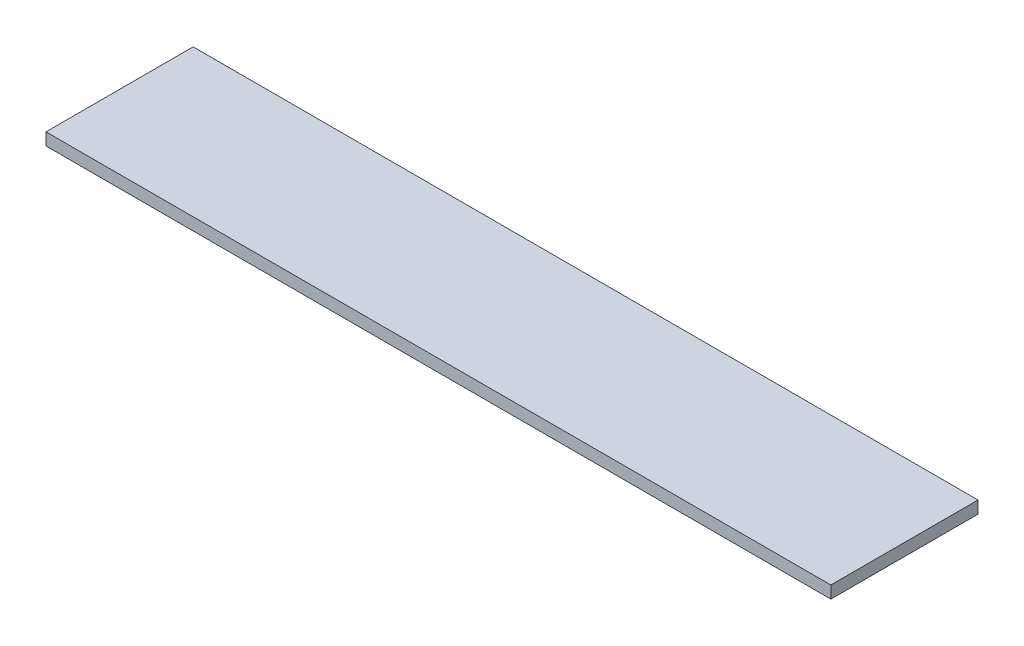
ISO-10303-21;
HEADER;
FILE_DESCRIPTION(('STEP AP214'),'2;1');
FILE_NAME('part.step','',(''),(''),'','','');
FILE_SCHEMA(('AUTOMOTIVE_DESIGN { 1 0 10303 214 1 1 1 1 }'));
ENDSEC;
DATA;
#1=APPLICATION_CONTEXT('core data for automotive mechanical design processes');
#2=APPLICATION_PROTOCOL_DEFINITION('international standard','automotive_design',2000,#1);
#3=PRODUCT_CONTEXT('',#1,'mechanical');
#4=PRODUCT('Part','Part','',(#3));
#5=PRODUCT_RELATED_PRODUCT_CATEGORY('part','',(#4));
#6=PRODUCT_DEFINITION_FORMATION('','',#4);
#7=PRODUCT_DEFINITION_CONTEXT('part definition',#1,'design');
#8=PRODUCT_DEFINITION('design','',#6,#7);
#9=PRODUCT_DEFINITION_SHAPE('','',#8);
#10=(LENGTH_UNIT() NAMED_UNIT(*) SI_UNIT(.MILLI.,.METRE.));
#11=(NAMED_UNIT(*) PLANE_ANGLE_UNIT() SI_UNIT($,.RADIAN.));
#12=(NAMED_UNIT(*) SI_UNIT($,.STERADIAN.) SOLID_ANGLE_UNIT());
#13=UNCERTAINTY_MEASURE_WITH_UNIT(LENGTH_MEASURE(1.E-05),#10,'distance_accuracy_value','');
#14=(GEOMETRIC_REPRESENTATION_CONTEXT(3) GLOBAL_UNCERTAINTY_ASSIGNED_CONTEXT((#13)) GLOBAL_UNIT_ASSIGNED_CONTEXT((#10,
#11,#12)) REPRESENTATION_CONTEXT('',''));
#15=CARTESIAN_POINT('',(0.,0.,0.));
#16=DIRECTION('',(0.,0.,1.));
#17=DIRECTION('',(1.,0.,0.));
#18=AXIS2_PLACEMENT_3D('',#15,#16,#17);
#19=CARTESIAN_POINT('',(0.,6.35,0.));
#20=DIRECTION('',(1.,0.,0.));
#21=DIRECTION('',(0.,0.,-1.));
#22=AXIS2_PLACEMENT_3D('',#19,#20,#21);
#23=PLANE('',#22);
#24=DIRECTION('',(0.,0.,1.));
#25=VECTOR('',#24,1.);
#26=CARTESIAN_POINT('',(0.,0.,0.));
#27=LINE('',#26,#25);
#28=CARTESIAN_POINT('',(0.,0.,-76.2));
#29=VERTEX_POINT('',#28);
#30=CARTESIAN_POINT('',(0.,0.,0.));
#31=VERTEX_POINT('',#30);
#32=EDGE_CURVE('E96',#29,#31,#27,.T.);
#33=ORIENTED_EDGE('',*,*,#32,.T.);
#34=DIRECTION('',(0.,-1.,0.));
#35=VECTOR('',#34,1.);
#36=CARTESIAN_POINT('',(0.,6.35,0.));
#37=LINE('',#36,#35);
#38=CARTESIAN_POINT('',(0.,6.35,0.));
#39=VERTEX_POINT('',#38);
#40=EDGE_CURVE('E11',#39,#31,#37,.T.);
#41=ORIENTED_EDGE('',*,*,#40,.F.);
#42=DIRECTION('',(0.,0.,1.));
#43=VECTOR('',#42,1.);
#44=CARTESIAN_POINT('',(0.,6.35,0.));
#45=LINE('',#44,#43);
#46=CARTESIAN_POINT('',(0.,6.35,-76.2));
#47=VERTEX_POINT('',#46);
#48=EDGE_CURVE('E84',#47,#39,#45,.T.);
#49=ORIENTED_EDGE('',*,*,#48,.F.);
#50=DIRECTION('',(0.,-1.,0.));
#51=VECTOR('',#50,1.);
#52=CARTESIAN_POINT('',(0.,6.35,-76.2));
#53=LINE('',#52,#51);
#54=EDGE_CURVE('E92',#47,#29,#53,.T.);
#55=ORIENTED_EDGE('',*,*,#54,.T.);
#56=EDGE_LOOP('',(#33,#41,#49,#55));
#57=FACE_BOUND('',#56,.T.);
#58=ADVANCED_FACE('F33',(#57),#23,.F.);
#59=CARTESIAN_POINT('',(0.,6.35,0.));
#60=DIRECTION('',(0.,0.,-1.));
#61=DIRECTION('',(-1.,0.,0.));
#62=AXIS2_PLACEMENT_3D('',#59,#60,#61);
#63=PLANE('',#62);
#64=DIRECTION('',(1.,0.,0.));
#65=VECTOR('',#64,1.);
#66=CARTESIAN_POINT('',(0.,0.,0.));
#67=LINE('',#66,#65);
#68=CARTESIAN_POINT('',(406.4,0.,0.));
#69=VERTEX_POINT('',#68);
#70=EDGE_CURVE('E88',#31,#69,#67,.T.);
#71=ORIENTED_EDGE('',*,*,#70,.T.);
#72=DIRECTION('',(0.,-1.,0.));
#73=VECTOR('',#72,1.);
#74=CARTESIAN_POINT('',(406.4,6.35,0.));
#75=LINE('',#74,#73);
#76=CARTESIAN_POINT('',(406.4,6.35,0.));
#77=VERTEX_POINT('',#76);
#78=EDGE_CURVE('E41',#77,#69,#75,.T.);
#79=ORIENTED_EDGE('',*,*,#78,.F.);
#80=DIRECTION('',(1.,0.,0.));
#81=VECTOR('',#80,1.);
#82=CARTESIAN_POINT('',(0.,6.35,0.));
#83=LINE('',#82,#81);
#84=EDGE_CURVE('E79',#39,#77,#83,.T.);
#85=ORIENTED_EDGE('',*,*,#84,.F.);
#86=ORIENTED_EDGE('',*,*,#40,.T.);
#87=EDGE_LOOP('',(#71,#79,#85,#86));
#88=FACE_BOUND('',#87,.T.);
#89=ADVANCED_FACE('F87',(#88),#63,.F.);
#90=CARTESIAN_POINT('',(406.4,6.35,0.));
#91=DIRECTION('',(-1.,0.,0.));
#92=DIRECTION('',(0.,0.,1.));
#93=AXIS2_PLACEMENT_3D('',#90,#91,#92);
#94=PLANE('',#93);
#95=DIRECTION('',(0.,0.,-1.));
#96=VECTOR('',#95,1.);
#97=CARTESIAN_POINT('',(406.4,0.,0.));
#98=LINE('',#97,#96);
#99=CARTESIAN_POINT('',(406.4,0.,-76.2));
#100=VERTEX_POINT('',#99);
#101=EDGE_CURVE('E66',#69,#100,#98,.T.);
#102=ORIENTED_EDGE('',*,*,#101,.T.);
#103=DIRECTION('',(0.,-1.,0.));
#104=VECTOR('',#103,1.);
#105=CARTESIAN_POINT('',(406.4,6.35,-76.2));
#106=LINE('',#105,#104);
#107=CARTESIAN_POINT('',(406.4,6.35,-76.2));
#108=VERTEX_POINT('',#107);
#109=EDGE_CURVE('E89',#108,#100,#106,.T.);
#110=ORIENTED_EDGE('',*,*,#109,.F.);
#111=DIRECTION('',(0.,0.,-1.));
#112=VECTOR('',#111,1.);
#113=CARTESIAN_POINT('',(406.4,6.35,0.));
#114=LINE('',#113,#112);
#115=EDGE_CURVE('E82',#77,#108,#114,.T.);
#116=ORIENTED_EDGE('',*,*,#115,.F.);
#117=ORIENTED_EDGE('',*,*,#78,.T.);
#118=EDGE_LOOP('',(#102,#110,#116,#117));
#119=FACE_BOUND('',#118,.T.);
#120=ADVANCED_FACE('F90',(#119),#94,.F.);
#121=CARTESIAN_POINT('',(0.,6.35,-76.2));
#122=DIRECTION('',(0.,0.,1.));
#123=DIRECTION('',(1.,0.,0.));
#124=AXIS2_PLACEMENT_3D('',#121,#122,#123);
#125=PLANE('',#124);
#126=DIRECTION('',(-1.,0.,0.));
#127=VECTOR('',#126,1.);
#128=CARTESIAN_POINT('',(0.,0.,-76.2));
#129=LINE('',#128,#127);
#130=EDGE_CURVE('E72',#100,#29,#129,.T.);
#131=ORIENTED_EDGE('',*,*,#130,.T.);
#132=ORIENTED_EDGE('',*,*,#54,.F.);
#133=DIRECTION('',(-1.,0.,0.));
#134=VECTOR('',#133,1.);
#135=CARTESIAN_POINT('',(0.,6.35,-76.2));
#136=LINE('',#135,#134);
#137=EDGE_CURVE('E49',#108,#47,#136,.T.);
#138=ORIENTED_EDGE('',*,*,#137,.F.);
#139=ORIENTED_EDGE('',*,*,#109,.T.);
#140=EDGE_LOOP('',(#131,#132,#138,#139));
#141=FACE_BOUND('',#140,.T.);
#142=ADVANCED_FACE('F103',(#141),#125,.F.);
#143=CARTESIAN_POINT('',(0.,6.35,0.));
#144=DIRECTION('',(0.,-1.,0.));
#145=DIRECTION('',(0.,0.,-1.));
#146=AXIS2_PLACEMENT_3D('',#143,#144,#145);
#147=PLANE('',#146);
#148=ORIENTED_EDGE('',*,*,#48,.T.);
#149=ORIENTED_EDGE('',*,*,#84,.T.);
#150=ORIENTED_EDGE('',*,*,#115,.T.);
#151=ORIENTED_EDGE('',*,*,#137,.T.);
#152=EDGE_LOOP('',(#148,#149,#150,#151));
#153=FACE_BOUND('',#152,.T.);
#154=ADVANCED_FACE('F80',(#153),#147,.F.);
#155=CARTESIAN_POINT('',(0.,0.,0.));
#156=DIRECTION('',(0.,-1.,0.));
#157=DIRECTION('',(0.,0.,-1.));
#158=AXIS2_PLACEMENT_3D('',#155,#156,#157);
#159=PLANE('',#158);
#160=ORIENTED_EDGE('',*,*,#32,.F.);
#161=ORIENTED_EDGE('',*,*,#130,.F.);
#162=ORIENTED_EDGE('',*,*,#101,.F.);
#163=ORIENTED_EDGE('',*,*,#70,.F.);
#164=EDGE_LOOP('',(#160,#161,#162,#163));
#165=FACE_BOUND('',#164,.T.);
#166=ADVANCED_FACE('F106',(#165),#159,.T.);
#167=CLOSED_SHELL('',(#58,#89,#120,#142,#154,#166));
#168=MANIFOLD_SOLID_BREP('B2',#167);
#169=ADVANCED_BREP_SHAPE_REPRESENTATION('',(#18,#168),#14);
#170=SHAPE_DEFINITION_REPRESENTATION(#9,#169);
ENDSEC;
END-ISO-10303-21;
